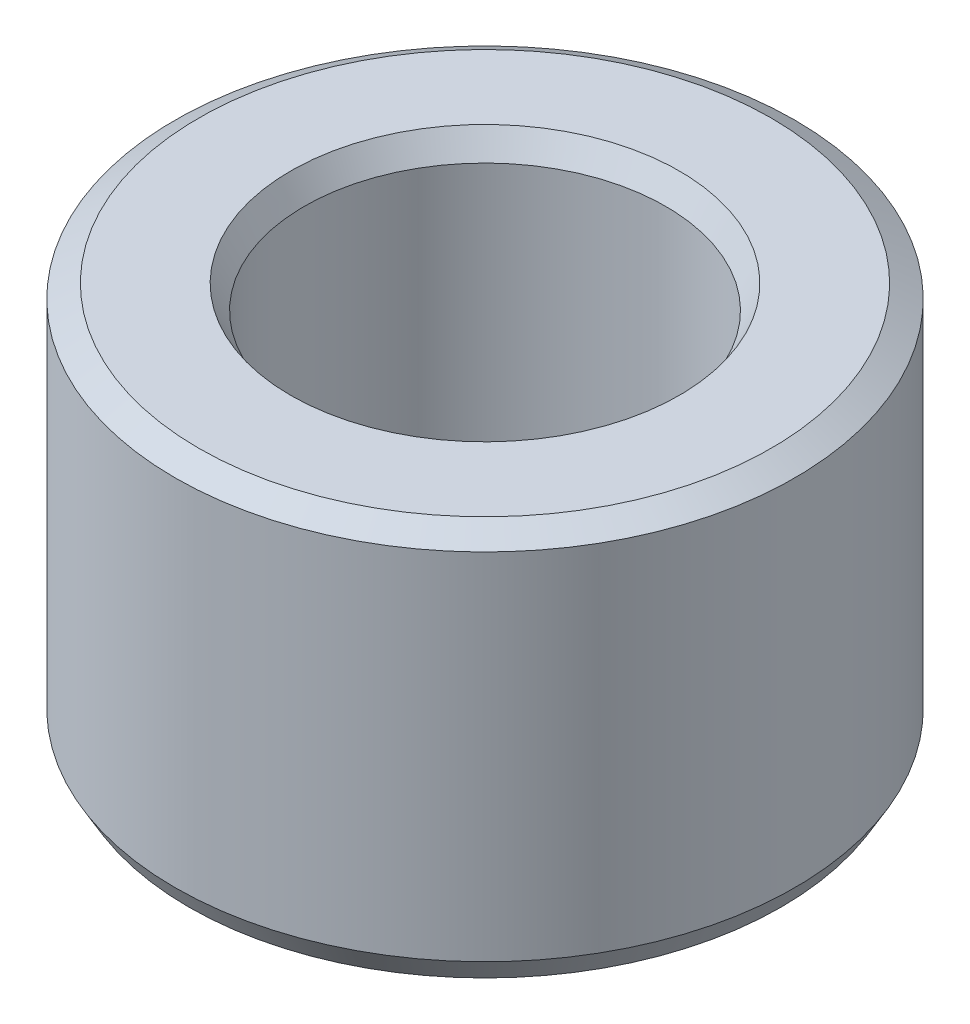
ISO-10303-21;
HEADER;
FILE_DESCRIPTION(('STEP AP214'),'2;1');
FILE_NAME('part.step','',(''),(''),'','','');
FILE_SCHEMA(('AUTOMOTIVE_DESIGN { 1 0 10303 214 1 1 1 1 }'));
ENDSEC;
DATA;
#1=APPLICATION_CONTEXT('core data for automotive mechanical design processes');
#2=APPLICATION_PROTOCOL_DEFINITION('international standard','automotive_design',2000,#1);
#3=PRODUCT_CONTEXT('',#1,'mechanical');
#4=PRODUCT('Part','Part','',(#3));
#5=PRODUCT_RELATED_PRODUCT_CATEGORY('part','',(#4));
#6=PRODUCT_DEFINITION_FORMATION('','',#4);
#7=PRODUCT_DEFINITION_CONTEXT('part definition',#1,'design');
#8=PRODUCT_DEFINITION('design','',#6,#7);
#9=PRODUCT_DEFINITION_SHAPE('','',#8);
#10=(LENGTH_UNIT() NAMED_UNIT(*) SI_UNIT(.MILLI.,.METRE.));
#11=(NAMED_UNIT(*) PLANE_ANGLE_UNIT() SI_UNIT($,.RADIAN.));
#12=(NAMED_UNIT(*) SI_UNIT($,.STERADIAN.) SOLID_ANGLE_UNIT());
#13=UNCERTAINTY_MEASURE_WITH_UNIT(LENGTH_MEASURE(1.E-05),#10,'distance_accuracy_value','');
#14=(GEOMETRIC_REPRESENTATION_CONTEXT(3) GLOBAL_UNCERTAINTY_ASSIGNED_CONTEXT((#13)) GLOBAL_UNIT_ASSIGNED_CONTEXT((#10,
#11,#12)) REPRESENTATION_CONTEXT('',''));
#15=CARTESIAN_POINT('',(0.,0.,0.));
#16=DIRECTION('',(0.,0.,1.));
#17=DIRECTION('',(1.,0.,0.));
#18=AXIS2_PLACEMENT_3D('',#15,#16,#17);
#19=CARTESIAN_POINT('',(0.,72.7995451627443,0.));
#20=DIRECTION('',(0.,-1.,0.));
#21=DIRECTION('',(0.,0.,-1.));
#22=AXIS2_PLACEMENT_3D('',#19,#20,#21);
#23=CYLINDRICAL_SURFACE('',#22,57.5);
#24=CARTESIAN_POINT('',(0.,4.40428969428539,0.));
#25=DIRECTION('',(0.,1.,0.));
#26=DIRECTION('',(0.,0.,1.));
#27=AXIS2_PLACEMENT_3D('',#24,#25,#26);
#28=CIRCLE('',#27,57.5);
#29=CARTESIAN_POINT('',(0.,4.40428969428539,57.5));
#30=VERTEX_POINT('',#29);
#31=EDGE_CURVE('E10',#30,#30,#28,.T.);
#32=ORIENTED_EDGE('',*,*,#31,.T.);
#33=EDGE_LOOP('',(#32));
#34=FACE_BOUND('',#33,.T.);
#35=CARTESIAN_POINT('',(0.,70.2567273221595,0.));
#36=DIRECTION('',(0.,1.,0.));
#37=DIRECTION('',(0.,0.,1.));
#38=AXIS2_PLACEMENT_3D('',#35,#36,#37);
#39=CIRCLE('',#38,57.5);
#40=CARTESIAN_POINT('',(0.,70.2567273221595,57.5));
#41=VERTEX_POINT('',#40);
#42=EDGE_CURVE('E50',#41,#41,#39,.F.);
#43=ORIENTED_EDGE('',*,*,#42,.T.);
#44=EDGE_LOOP('',(#43));
#45=FACE_BOUND('',#44,.T.);
#46=ADVANCED_FACE('F39',(#34,#45),#23,.T.);
#47=CARTESIAN_POINT('',(0.,72.7995451627443,0.));
#48=DIRECTION('',(0.,1.,0.));
#49=DIRECTION('',(0.,0.,1.));
#50=AXIS2_PLACEMENT_3D('',#47,#48,#49);
#51=PLANE('',#50);
#52=CARTESIAN_POINT('',(0.,72.7995451627443,0.));
#53=DIRECTION('',(0.,1.,0.));
#54=DIRECTION('',(0.,0.,1.));
#55=AXIS2_PLACEMENT_3D('',#52,#53,#54);
#56=CIRCLE('',#55,36.0674304702642);
#57=CARTESIAN_POINT('',(0.,72.7995451627443,36.0674304702642));
#58=VERTEX_POINT('',#57);
#59=EDGE_CURVE('E58',#58,#58,#56,.F.);
#60=ORIENTED_EDGE('',*,*,#59,.T.);
#61=EDGE_LOOP('',(#60));
#62=FACE_BOUND('',#61,.T.);
#63=CARTESIAN_POINT('',(0.,72.7995451627443,0.));
#64=DIRECTION('',(0.,1.,0.));
#65=DIRECTION('',(0.,0.,1.));
#66=AXIS2_PLACEMENT_3D('',#63,#64,#65);
#67=CIRCLE('',#66,53.0957103057146);
#68=CARTESIAN_POINT('',(0.,72.7995451627443,53.0957103057146));
#69=VERTEX_POINT('',#68);
#70=EDGE_CURVE('E61',#69,#69,#67,.T.);
#71=ORIENTED_EDGE('',*,*,#70,.T.);
#72=EDGE_LOOP('',(#71));
#73=FACE_BOUND('',#72,.T.);
#74=ADVANCED_FACE('F88',(#62,#73),#51,.T.);
#75=CARTESIAN_POINT('',(0.,0.,0.));
#76=DIRECTION('',(0.,1.,0.));
#77=DIRECTION('',(0.,0.,1.));
#78=AXIS2_PLACEMENT_3D('',#75,#76,#77);
#79=PLANE('',#78);
#80=CARTESIAN_POINT('',(0.,0.,0.));
#81=DIRECTION('',(0.,1.,0.));
#82=DIRECTION('',(0.,0.,1.));
#83=AXIS2_PLACEMENT_3D('',#80,#81,#82);
#84=CIRCLE('',#83,37.9289023239649);
#85=CARTESIAN_POINT('',(0.,0.,37.9289023239649));
#86=VERTEX_POINT('',#85);
#87=EDGE_CURVE('E51',#86,#86,#84,.T.);
#88=ORIENTED_EDGE('',*,*,#87,.T.);
#89=EDGE_LOOP('',(#88));
#90=FACE_BOUND('',#89,.T.);
#91=CARTESIAN_POINT('',(0.,0.,0.));
#92=DIRECTION('',(0.,1.,0.));
#93=DIRECTION('',(0.,0.,1.));
#94=AXIS2_PLACEMENT_3D('',#91,#92,#93);
#95=CIRCLE('',#94,54.9571821594152);
#96=CARTESIAN_POINT('',(0.,0.,54.9571821594152));
#97=VERTEX_POINT('',#96);
#98=EDGE_CURVE('E54',#97,#97,#95,.F.);
#99=ORIENTED_EDGE('',*,*,#98,.T.);
#100=EDGE_LOOP('',(#99));
#101=FACE_BOUND('',#100,.T.);
#102=ADVANCED_FACE('F83',(#90,#101),#79,.F.);
#103=CARTESIAN_POINT('',(0.,72.7995451627443,0.));
#104=DIRECTION('',(0.,-1.,0.));
#105=DIRECTION('',(0.,0.,-1.));
#106=AXIS2_PLACEMENT_3D('',#103,#104,#105);
#107=CYLINDRICAL_SURFACE('',#106,33.5246126296794);
#108=CARTESIAN_POINT('',(0.,68.3952554684589,0.));
#109=DIRECTION('',(0.,1.,0.));
#110=DIRECTION('',(0.,0.,1.));
#111=AXIS2_PLACEMENT_3D('',#108,#109,#110);
#112=CIRCLE('',#111,33.5246126296794);
#113=CARTESIAN_POINT('',(0.,68.3952554684589,33.5246126296794));
#114=VERTEX_POINT('',#113);
#115=EDGE_CURVE('E67',#114,#114,#112,.T.);
#116=ORIENTED_EDGE('',*,*,#115,.T.);
#117=EDGE_LOOP('',(#116));
#118=FACE_BOUND('',#117,.T.);
#119=CARTESIAN_POINT('',(0.,2.5428178405848,0.));
#120=DIRECTION('',(0.,1.,0.));
#121=DIRECTION('',(0.,0.,1.));
#122=AXIS2_PLACEMENT_3D('',#119,#120,#121);
#123=CIRCLE('',#122,33.5246126296794);
#124=CARTESIAN_POINT('',(0.,2.5428178405848,33.5246126296794));
#125=VERTEX_POINT('',#124);
#126=EDGE_CURVE('E69',#125,#125,#123,.F.);
#127=ORIENTED_EDGE('',*,*,#126,.T.);
#128=EDGE_LOOP('',(#127));
#129=FACE_BOUND('',#128,.T.);
#130=ADVANCED_FACE('F71',(#118,#129),#107,.F.);
#131=CARTESIAN_POINT('',(0.,68.3952554684589,0.));
#132=DIRECTION('',(0.,1.,0.));
#133=DIRECTION('',(0.,0.,1.));
#134=AXIS2_PLACEMENT_3D('',#131,#132,#133);
#135=CONICAL_SURFACE('',#134,33.5246126296794,0.523598775598305);
#136=ORIENTED_EDGE('',*,*,#59,.F.);
#137=EDGE_LOOP('',(#136));
#138=FACE_BOUND('',#137,.T.);
#139=ORIENTED_EDGE('',*,*,#115,.F.);
#140=EDGE_LOOP('',(#139));
#141=FACE_BOUND('',#140,.T.);
#142=ADVANCED_FACE('F77',(#138,#141),#135,.F.);
#143=CARTESIAN_POINT('',(0.,0.,0.));
#144=DIRECTION('',(0.,-1.,0.));
#145=DIRECTION('',(0.,0.,-1.));
#146=AXIS2_PLACEMENT_3D('',#143,#144,#145);
#147=CONICAL_SURFACE('',#146,37.9289023239649,1.0471975511966);
#148=ORIENTED_EDGE('',*,*,#126,.F.);
#149=EDGE_LOOP('',(#148));
#150=FACE_BOUND('',#149,.T.);
#151=ORIENTED_EDGE('',*,*,#87,.F.);
#152=EDGE_LOOP('',(#151));
#153=FACE_BOUND('',#152,.T.);
#154=ADVANCED_FACE('F73',(#150,#153),#147,.F.);
#155=CARTESIAN_POINT('',(0.,4.40428969428539,0.));
#156=DIRECTION('',(0.,1.,0.));
#157=DIRECTION('',(0.,0.,1.));
#158=AXIS2_PLACEMENT_3D('',#155,#156,#157);
#159=CONICAL_SURFACE('',#158,57.5,0.523598775598304);
#160=ORIENTED_EDGE('',*,*,#98,.F.);
#161=EDGE_LOOP('',(#160));
#162=FACE_BOUND('',#161,.T.);
#163=ORIENTED_EDGE('',*,*,#31,.F.);
#164=EDGE_LOOP('',(#163));
#165=FACE_BOUND('',#164,.T.);
#166=ADVANCED_FACE('F76',(#162,#165),#159,.T.);
#167=CARTESIAN_POINT('',(0.,72.7995451627443,0.));
#168=DIRECTION('',(0.,-1.,0.));
#169=DIRECTION('',(0.,0.,-1.));
#170=AXIS2_PLACEMENT_3D('',#167,#168,#169);
#171=CONICAL_SURFACE('',#170,53.0957103057146,1.0471975511966);
#172=ORIENTED_EDGE('',*,*,#42,.F.);
#173=EDGE_LOOP('',(#172));
#174=FACE_BOUND('',#173,.T.);
#175=ORIENTED_EDGE('',*,*,#70,.F.);
#176=EDGE_LOOP('',(#175));
#177=FACE_BOUND('',#176,.T.);
#178=ADVANCED_FACE('F45',(#174,#177),#171,.T.);
#179=CLOSED_SHELL('',(#46,#74,#102,#130,#142,#154,#166,#178));
#180=MANIFOLD_SOLID_BREP('B2',#179);
#181=ADVANCED_BREP_SHAPE_REPRESENTATION('',(#18,#180),#14);
#182=SHAPE_DEFINITION_REPRESENTATION(#9,#181);
ENDSEC;
END-ISO-10303-21;
